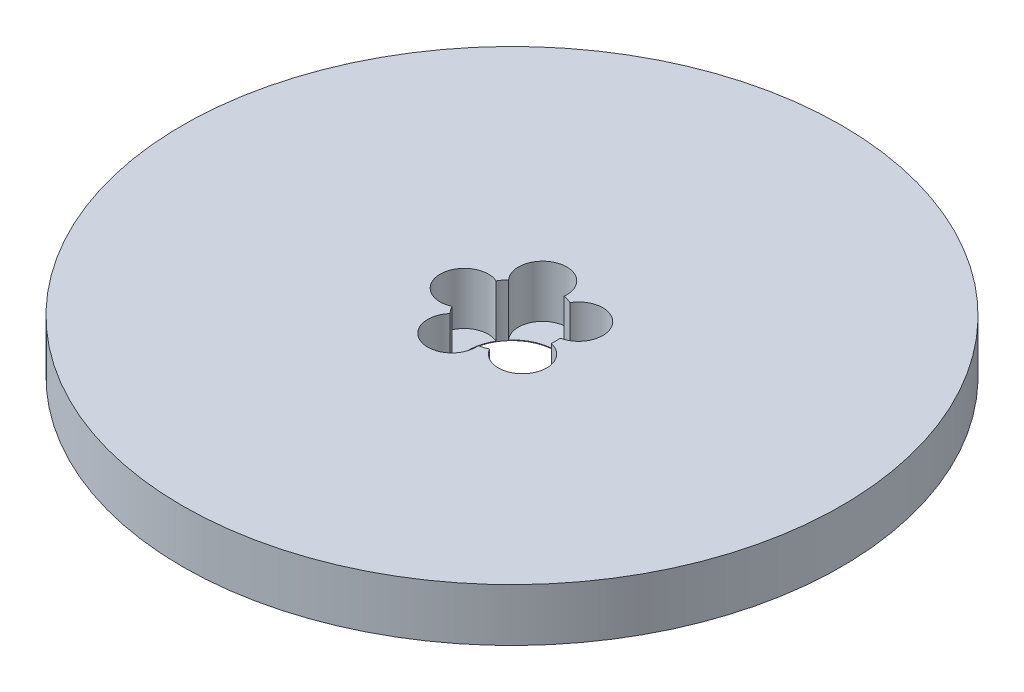
ISO-10303-21;
HEADER;
FILE_DESCRIPTION(('STEP AP214'),'2;1');
FILE_NAME('part.step','',(''),(''),'','','');
FILE_SCHEMA(('AUTOMOTIVE_DESIGN { 1 0 10303 214 1 1 1 1 }'));
ENDSEC;
DATA;
#1=APPLICATION_CONTEXT('core data for automotive mechanical design processes');
#2=APPLICATION_PROTOCOL_DEFINITION('international standard','automotive_design',2000,#1);
#3=PRODUCT_CONTEXT('',#1,'mechanical');
#4=PRODUCT('Part','Part','',(#3));
#5=PRODUCT_RELATED_PRODUCT_CATEGORY('part','',(#4));
#6=PRODUCT_DEFINITION_FORMATION('','',#4);
#7=PRODUCT_DEFINITION_CONTEXT('part definition',#1,'design');
#8=PRODUCT_DEFINITION('design','',#6,#7);
#9=PRODUCT_DEFINITION_SHAPE('','',#8);
#10=(LENGTH_UNIT() NAMED_UNIT(*) SI_UNIT(.MILLI.,.METRE.));
#11=(NAMED_UNIT(*) PLANE_ANGLE_UNIT() SI_UNIT($,.RADIAN.));
#12=(NAMED_UNIT(*) SI_UNIT($,.STERADIAN.) SOLID_ANGLE_UNIT());
#13=UNCERTAINTY_MEASURE_WITH_UNIT(LENGTH_MEASURE(1.E-05),#10,'distance_accuracy_value','');
#14=(GEOMETRIC_REPRESENTATION_CONTEXT(3) GLOBAL_UNCERTAINTY_ASSIGNED_CONTEXT((#13)) GLOBAL_UNIT_ASSIGNED_CONTEXT((#10,
#11,#12)) REPRESENTATION_CONTEXT('',''));
#15=CARTESIAN_POINT('',(0.,0.,0.));
#16=DIRECTION('',(0.,0.,1.));
#17=DIRECTION('',(1.,0.,0.));
#18=AXIS2_PLACEMENT_3D('',#15,#16,#17);
#19=CARTESIAN_POINT('',(0.,6.,0.));
#20=DIRECTION('',(0.,-1.,0.));
#21=DIRECTION('',(0.,0.,-1.));
#22=AXIS2_PLACEMENT_3D('',#19,#20,#21);
#23=CYLINDRICAL_SURFACE('',#22,37.5);
#24=CARTESIAN_POINT('',(0.,6.,0.));
#25=DIRECTION('',(0.,1.,0.));
#26=DIRECTION('',(0.,0.,1.));
#27=AXIS2_PLACEMENT_3D('',#24,#25,#26);
#28=CIRCLE('',#27,37.5);
#29=CARTESIAN_POINT('',(0.,6.,37.5));
#30=VERTEX_POINT('',#29);
#31=EDGE_CURVE('E157',#30,#30,#28,.T.);
#32=ORIENTED_EDGE('',*,*,#31,.F.);
#33=EDGE_LOOP('',(#32));
#34=FACE_BOUND('',#33,.T.);
#35=CARTESIAN_POINT('',(0.,0.,0.));
#36=DIRECTION('',(0.,1.,0.));
#37=DIRECTION('',(0.,0.,1.));
#38=AXIS2_PLACEMENT_3D('',#35,#36,#37);
#39=CIRCLE('',#38,37.5);
#40=CARTESIAN_POINT('',(0.,0.,37.5));
#41=VERTEX_POINT('',#40);
#42=EDGE_CURVE('E150',#41,#41,#39,.T.);
#43=ORIENTED_EDGE('',*,*,#42,.T.);
#44=EDGE_LOOP('',(#43));
#45=FACE_BOUND('',#44,.T.);
#46=ADVANCED_FACE('F39',(#34,#45),#23,.T.);
#47=CARTESIAN_POINT('',(0.,6.,0.));
#48=DIRECTION('',(0.,1.,0.));
#49=DIRECTION('',(0.,0.,1.));
#50=AXIS2_PLACEMENT_3D('',#47,#48,#49);
#51=PLANE('',#50);
#52=CARTESIAN_POINT('',(-1.67758170406622,6.,-5.16306559287081));
#53=DIRECTION('',(0.,1.,0.));
#54=DIRECTION('',(-0.95105651629515,0.,0.309016994374958));
#55=AXIS2_PLACEMENT_3D('',#52,#53,#54);
#56=CIRCLE('',#55,2.74677097780781);
#57=CARTESIAN_POINT('',(1.05531752534403,6.,-4.88736175463836));
#58=VERTEX_POINT('',#57);
#59=CARTESIAN_POINT('',(-3.72648897445981,6.,-3.3336586392775));
#60=VERTEX_POINT('',#59);
#61=EDGE_CURVE('E194',#58,#60,#56,.T.);
#62=ORIENTED_EDGE('',*,*,#61,.F.);
#63=CARTESIAN_POINT('',(0.,6.,0.));
#64=DIRECTION('',(0.,1.,0.));
#65=DIRECTION('',(0.,0.,1.));
#66=AXIS2_PLACEMENT_3D('',#63,#64,#65);
#67=CIRCLE('',#66,5.);
#68=CARTESIAN_POINT('',(2.01894934952956,6.,-4.57425879504365));
#69=VERTEX_POINT('',#68);
#70=EDGE_CURVE('E147',#69,#58,#67,.T.);
#71=ORIENTED_EDGE('',*,*,#70,.F.);
#72=CARTESIAN_POINT('',(4.39196592015014,6.,-3.19095002253934));
#73=DIRECTION('',(0.,1.,0.));
#74=DIRECTION('',(-0.58778525229248,0.,-0.809016994374942));
#75=AXIS2_PLACEMENT_3D('',#72,#73,#74);
#76=CIRCLE('',#75,2.74677097780781);
#77=CARTESIAN_POINT('',(4.97426829403355,6.,-0.506611230602483));
#78=VERTEX_POINT('',#77);
#79=EDGE_CURVE('E254',#78,#69,#76,.T.);
#80=ORIENTED_EDGE('',*,*,#79,.F.);
#81=CARTESIAN_POINT('',(4.97426829403356,6.,0.506611230602411));
#82=VERTEX_POINT('',#81);
#83=EDGE_CURVE('E144',#82,#78,#67,.T.);
#84=ORIENTED_EDGE('',*,*,#83,.F.);
#85=CARTESIAN_POINT('',(4.39196592015019,6.,3.19095002253927));
#86=DIRECTION('',(0.,1.,0.));
#87=DIRECTION('',(0.587785252292469,0.,-0.809016994374951));
#88=AXIS2_PLACEMENT_3D('',#85,#86,#87);
#89=CIRCLE('',#88,2.74677097780781);
#90=CARTESIAN_POINT('',(2.01894934952963,6.,4.57425879504362));
#91=VERTEX_POINT('',#90);
#92=EDGE_CURVE('E141',#91,#82,#89,.T.);
#93=ORIENTED_EDGE('',*,*,#92,.F.);
#94=CARTESIAN_POINT('',(1.0553175253441,6.,4.88736175463834));
#95=VERTEX_POINT('',#94);
#96=EDGE_CURVE('E134',#95,#91,#67,.T.);
#97=ORIENTED_EDGE('',*,*,#96,.F.);
#98=CARTESIAN_POINT('',(-1.67758170406615,6.,5.16306559287083));
#99=DIRECTION('',(0.,1.,0.));
#100=DIRECTION('',(0.951056516295155,0.,0.309016994374945));
#101=AXIS2_PLACEMENT_3D('',#98,#99,#100);
#102=CIRCLE('',#101,2.74677097780781);
#103=CARTESIAN_POINT('',(-3.72648897445976,6.,3.33365863927755));
#104=VERTEX_POINT('',#103);
#105=EDGE_CURVE('E111',#104,#95,#102,.T.);
#106=ORIENTED_EDGE('',*,*,#105,.F.);
#107=CARTESIAN_POINT('',(-4.32204619444748,6.,2.51394444908038));
#108=VERTEX_POINT('',#107);
#109=EDGE_CURVE('E145',#108,#104,#67,.T.);
#110=ORIENTED_EDGE('',*,*,#109,.F.);
#111=CARTESIAN_POINT('',(-5.42876843216803,6.,0.));
#112=DIRECTION('',(0.,1.,0.));
#113=DIRECTION('',(0.,0.,1.));
#114=AXIS2_PLACEMENT_3D('',#111,#112,#113);
#115=CIRCLE('',#114,2.74677097780781);
#116=CARTESIAN_POINT('',(-4.32204619444748,6.,-2.51394444908038));
#117=VERTEX_POINT('',#116);
#118=EDGE_CURVE('E153',#117,#108,#115,.T.);
#119=ORIENTED_EDGE('',*,*,#118,.F.);
#120=EDGE_CURVE('E146',#60,#117,#67,.T.);
#121=ORIENTED_EDGE('',*,*,#120,.F.);
#122=EDGE_LOOP('',(#62,#71,#80,#84,#93,#97,#106,#110,#119,#121));
#123=FACE_BOUND('',#122,.T.);
#124=ORIENTED_EDGE('',*,*,#31,.T.);
#125=EDGE_LOOP('',(#124));
#126=FACE_BOUND('',#125,.T.);
#127=ADVANCED_FACE('F139',(#123,#126),#51,.T.);
#128=CARTESIAN_POINT('',(0.,0.,0.));
#129=DIRECTION('',(0.,1.,0.));
#130=DIRECTION('',(0.,0.,1.));
#131=AXIS2_PLACEMENT_3D('',#128,#129,#130);
#132=PLANE('',#131);
#133=CARTESIAN_POINT('',(0.,0.,0.));
#134=DIRECTION('',(0.,1.,0.));
#135=DIRECTION('',(0.,0.,1.));
#136=AXIS2_PLACEMENT_3D('',#133,#134,#135);
#137=CIRCLE('',#136,5.);
#138=CARTESIAN_POINT('',(0.,0.,5.));
#139=VERTEX_POINT('',#138);
#140=EDGE_CURVE('E154',#139,#139,#137,.T.);
#141=ORIENTED_EDGE('',*,*,#140,.T.);
#142=EDGE_LOOP('',(#141));
#143=FACE_BOUND('',#142,.T.);
#144=ORIENTED_EDGE('',*,*,#42,.F.);
#145=EDGE_LOOP('',(#144));
#146=FACE_BOUND('',#145,.T.);
#147=ADVANCED_FACE('F213',(#143,#146),#132,.F.);
#148=CARTESIAN_POINT('',(0.,6.,0.));
#149=DIRECTION('',(0.,-1.,0.));
#150=DIRECTION('',(0.,0.,-1.));
#151=AXIS2_PLACEMENT_3D('',#148,#149,#150);
#152=CYLINDRICAL_SURFACE('',#151,5.);
#153=DIRECTION('',(0.,1.,0.));
#154=VECTOR('',#153,1.);
#155=CARTESIAN_POINT('',(1.05531752534403,3.03391343226891,-4.88736175463836));
#156=LINE('',#155,#154);
#157=CARTESIAN_POINT('',(1.05531752534403,0.0678268645378285,-4.88736175463836));
#158=VERTEX_POINT('',#157);
#159=EDGE_CURVE('E11',#158,#58,#156,.T.);
#160=ORIENTED_EDGE('',*,*,#159,.F.);
#161=CARTESIAN_POINT('',(0.,0.0678268645378285,0.));
#162=DIRECTION('',(0.,1.,0.));
#163=DIRECTION('',(0.,0.,1.));
#164=AXIS2_PLACEMENT_3D('',#161,#162,#163);
#165=CIRCLE('',#164,5.);
#166=CARTESIAN_POINT('',(-3.72648897445981,0.0678268645378285,-3.3336586392775));
#167=VERTEX_POINT('',#166);
#168=EDGE_CURVE('E189',#158,#167,#165,.T.);
#169=ORIENTED_EDGE('',*,*,#168,.T.);
#170=DIRECTION('',(0.,1.,0.));
#171=VECTOR('',#170,1.);
#172=CARTESIAN_POINT('',(-3.72648897445981,3.03391343226891,-3.3336586392775));
#173=LINE('',#172,#171);
#174=EDGE_CURVE('E46',#60,#167,#173,.F.);
#175=ORIENTED_EDGE('',*,*,#174,.F.);
#176=ORIENTED_EDGE('',*,*,#120,.T.);
#177=DIRECTION('',(0.,1.,0.));
#178=VECTOR('',#177,1.);
#179=CARTESIAN_POINT('',(-4.32204619444748,3.03391343226891,-2.51394444908038));
#180=LINE('',#179,#178);
#181=CARTESIAN_POINT('',(-4.32204619444748,0.0678268645378285,-2.51394444908038));
#182=VERTEX_POINT('',#181);
#183=EDGE_CURVE('E168',#182,#117,#180,.T.);
#184=ORIENTED_EDGE('',*,*,#183,.F.);
#185=CARTESIAN_POINT('',(0.,0.0678268645378285,0.));
#186=DIRECTION('',(0.,1.,0.));
#187=DIRECTION('',(0.,0.,1.));
#188=AXIS2_PLACEMENT_3D('',#185,#186,#187);
#189=CIRCLE('',#188,5.);
#190=CARTESIAN_POINT('',(-4.32204619444748,0.0678268645378285,2.51394444908038));
#191=VERTEX_POINT('',#190);
#192=EDGE_CURVE('E165',#182,#191,#189,.T.);
#193=ORIENTED_EDGE('',*,*,#192,.T.);
#194=DIRECTION('',(0.,1.,0.));
#195=VECTOR('',#194,1.);
#196=CARTESIAN_POINT('',(-4.32204619444748,3.03391343226891,2.51394444908038));
#197=LINE('',#196,#195);
#198=EDGE_CURVE('E170',#108,#191,#197,.F.);
#199=ORIENTED_EDGE('',*,*,#198,.F.);
#200=ORIENTED_EDGE('',*,*,#109,.T.);
#201=DIRECTION('',(0.,1.,0.));
#202=VECTOR('',#201,1.);
#203=CARTESIAN_POINT('',(-3.72648897445976,3.03391343226891,3.33365863927755));
#204=LINE('',#203,#202);
#205=CARTESIAN_POINT('',(-3.72648897445976,0.0678268645378285,3.33365863927755));
#206=VERTEX_POINT('',#205);
#207=EDGE_CURVE('E121',#206,#104,#204,.T.);
#208=ORIENTED_EDGE('',*,*,#207,.F.);
#209=CARTESIAN_POINT('',(0.,0.0678268645378285,0.));
#210=DIRECTION('',(0.,1.,0.));
#211=DIRECTION('',(0.,0.,1.));
#212=AXIS2_PLACEMENT_3D('',#209,#210,#211);
#213=CIRCLE('',#212,5.);
#214=CARTESIAN_POINT('',(1.0553175253441,0.0678268645378285,4.88736175463834));
#215=VERTEX_POINT('',#214);
#216=EDGE_CURVE('E136',#206,#215,#213,.T.);
#217=ORIENTED_EDGE('',*,*,#216,.T.);
#218=DIRECTION('',(0.,1.,0.));
#219=VECTOR('',#218,1.);
#220=CARTESIAN_POINT('',(1.0553175253441,3.03391343226891,4.88736175463834));
#221=LINE('',#220,#219);
#222=EDGE_CURVE('E117',#95,#215,#221,.F.);
#223=ORIENTED_EDGE('',*,*,#222,.F.);
#224=ORIENTED_EDGE('',*,*,#96,.T.);
#225=DIRECTION('',(0.,1.,0.));
#226=VECTOR('',#225,1.);
#227=CARTESIAN_POINT('',(2.01894934952963,3.03391343226891,4.57425879504362));
#228=LINE('',#227,#226);
#229=CARTESIAN_POINT('',(2.01894934952963,0.0678268645378285,4.57425879504362));
#230=VERTEX_POINT('',#229);
#231=EDGE_CURVE('E182',#230,#91,#228,.T.);
#232=ORIENTED_EDGE('',*,*,#231,.F.);
#233=CARTESIAN_POINT('',(0.,0.0678268645378285,0.));
#234=DIRECTION('',(0.,1.,0.));
#235=DIRECTION('',(0.,0.,1.));
#236=AXIS2_PLACEMENT_3D('',#233,#234,#235);
#237=CIRCLE('',#236,5.);
#238=CARTESIAN_POINT('',(4.97426829403356,0.0678268645378285,0.506611230602411));
#239=VERTEX_POINT('',#238);
#240=EDGE_CURVE('E174',#230,#239,#237,.T.);
#241=ORIENTED_EDGE('',*,*,#240,.T.);
#242=DIRECTION('',(0.,1.,0.));
#243=VECTOR('',#242,1.);
#244=CARTESIAN_POINT('',(4.97426829403356,3.03391343226891,0.506611230602411));
#245=LINE('',#244,#243);
#246=EDGE_CURVE('E177',#82,#239,#245,.F.);
#247=ORIENTED_EDGE('',*,*,#246,.F.);
#248=ORIENTED_EDGE('',*,*,#83,.T.);
#249=DIRECTION('',(0.,1.,0.));
#250=VECTOR('',#249,1.);
#251=CARTESIAN_POINT('',(4.97426829403355,3.03391343226891,-0.506611230602483));
#252=LINE('',#251,#250);
#253=CARTESIAN_POINT('',(4.97426829403355,0.0678268645378285,-0.506611230602483));
#254=VERTEX_POINT('',#253);
#255=EDGE_CURVE('E187',#254,#78,#252,.T.);
#256=ORIENTED_EDGE('',*,*,#255,.F.);
#257=CARTESIAN_POINT('',(0.,0.0678268645378285,0.));
#258=DIRECTION('',(0.,1.,0.));
#259=DIRECTION('',(0.,0.,1.));
#260=AXIS2_PLACEMENT_3D('',#257,#258,#259);
#261=CIRCLE('',#260,5.);
#262=CARTESIAN_POINT('',(2.01894934952956,0.0678268645378285,-4.57425879504365));
#263=VERTEX_POINT('',#262);
#264=EDGE_CURVE('E181',#254,#263,#261,.T.);
#265=ORIENTED_EDGE('',*,*,#264,.T.);
#266=DIRECTION('',(0.,1.,0.));
#267=VECTOR('',#266,1.);
#268=CARTESIAN_POINT('',(2.01894934952956,3.03391343226891,-4.57425879504365));
#269=LINE('',#268,#267);
#270=EDGE_CURVE('E186',#69,#263,#269,.F.);
#271=ORIENTED_EDGE('',*,*,#270,.F.);
#272=ORIENTED_EDGE('',*,*,#70,.T.);
#273=EDGE_LOOP('',(#160,#169,#175,#176,#184,#193,#199,#200,#208,#217,#223,#224,#232,#241,#247,
#248,#256,#265,#271,#272));
#274=FACE_BOUND('',#273,.T.);
#275=ORIENTED_EDGE('',*,*,#140,.F.);
#276=EDGE_LOOP('',(#275));
#277=FACE_BOUND('',#276,.T.);
#278=ADVANCED_FACE('F135',(#274,#277),#152,.F.);
#279=CARTESIAN_POINT('',(-5.42876843216803,0.0678268645378285,0.));
#280=DIRECTION('',(0.,1.,0.));
#281=DIRECTION('',(0.,0.,1.));
#282=AXIS2_PLACEMENT_3D('',#279,#280,#281);
#283=CYLINDRICAL_SURFACE('',#282,2.74677097780781);
#284=ORIENTED_EDGE('',*,*,#183,.T.);
#285=ORIENTED_EDGE('',*,*,#118,.T.);
#286=ORIENTED_EDGE('',*,*,#198,.T.);
#287=CARTESIAN_POINT('',(-5.42876843216803,0.0678268645378285,0.));
#288=DIRECTION('',(0.,1.,0.));
#289=DIRECTION('',(0.,0.,1.));
#290=AXIS2_PLACEMENT_3D('',#287,#288,#289);
#291=CIRCLE('',#290,2.74677097780781);
#292=EDGE_CURVE('E158',#182,#191,#291,.T.);
#293=ORIENTED_EDGE('',*,*,#292,.F.);
#294=EDGE_LOOP('',(#284,#285,#286,#293));
#295=FACE_BOUND('',#294,.T.);
#296=ADVANCED_FACE('F221',(#295),#283,.F.);
#297=CARTESIAN_POINT('',(-5.42876843216803,0.0678268645378285,0.));
#298=DIRECTION('',(0.,1.,0.));
#299=DIRECTION('',(0.,0.,1.));
#300=AXIS2_PLACEMENT_3D('',#297,#298,#299);
#301=PLANE('',#300);
#302=ORIENTED_EDGE('',*,*,#292,.T.);
#303=ORIENTED_EDGE('',*,*,#192,.F.);
#304=EDGE_LOOP('',(#302,#303));
#305=FACE_BOUND('',#304,.T.);
#306=ADVANCED_FACE('F227',(#305),#301,.T.);
#307=CARTESIAN_POINT('',(-1.67758170406615,0.0678268645378285,5.16306559287083));
#308=DIRECTION('',(0.,1.,0.));
#309=DIRECTION('',(0.,0.,1.));
#310=AXIS2_PLACEMENT_3D('',#307,#308,#309);
#311=CYLINDRICAL_SURFACE('',#310,2.74677097780781);
#312=ORIENTED_EDGE('',*,*,#207,.T.);
#313=ORIENTED_EDGE('',*,*,#105,.T.);
#314=ORIENTED_EDGE('',*,*,#222,.T.);
#315=CARTESIAN_POINT('',(-1.67758170406615,0.0678268645378285,5.16306559287083));
#316=DIRECTION('',(0.,1.,0.));
#317=DIRECTION('',(0.951056516295155,0.,0.309016994374945));
#318=AXIS2_PLACEMENT_3D('',#315,#316,#317);
#319=CIRCLE('',#318,2.74677097780781);
#320=EDGE_CURVE('E127',#206,#215,#319,.T.);
#321=ORIENTED_EDGE('',*,*,#320,.F.);
#322=EDGE_LOOP('',(#312,#313,#314,#321));
#323=FACE_BOUND('',#322,.T.);
#324=ADVANCED_FACE('F116',(#323),#311,.F.);
#325=CARTESIAN_POINT('',(-1.67758170406615,0.0678268645378285,5.16306559287083));
#326=DIRECTION('',(0.,1.,0.));
#327=DIRECTION('',(0.951056516295155,0.,0.309016994374945));
#328=AXIS2_PLACEMENT_3D('',#325,#326,#327);
#329=PLANE('',#328);
#330=ORIENTED_EDGE('',*,*,#320,.T.);
#331=ORIENTED_EDGE('',*,*,#216,.F.);
#332=EDGE_LOOP('',(#330,#331));
#333=FACE_BOUND('',#332,.T.);
#334=ADVANCED_FACE('F234',(#333),#329,.T.);
#335=CARTESIAN_POINT('',(4.39196592015019,0.0678268645378285,3.19095002253927));
#336=DIRECTION('',(0.,1.,0.));
#337=DIRECTION('',(0.,0.,1.));
#338=AXIS2_PLACEMENT_3D('',#335,#336,#337);
#339=CYLINDRICAL_SURFACE('',#338,2.74677097780781);
#340=ORIENTED_EDGE('',*,*,#231,.T.);
#341=ORIENTED_EDGE('',*,*,#92,.T.);
#342=ORIENTED_EDGE('',*,*,#246,.T.);
#343=CARTESIAN_POINT('',(4.39196592015019,0.0678268645378285,3.19095002253927));
#344=DIRECTION('',(0.,1.,0.));
#345=DIRECTION('',(0.587785252292469,0.,-0.809016994374951));
#346=AXIS2_PLACEMENT_3D('',#343,#344,#345);
#347=CIRCLE('',#346,2.74677097780781);
#348=EDGE_CURVE('E130',#230,#239,#347,.T.);
#349=ORIENTED_EDGE('',*,*,#348,.F.);
#350=EDGE_LOOP('',(#340,#341,#342,#349));
#351=FACE_BOUND('',#350,.T.);
#352=ADVANCED_FACE('F240',(#351),#339,.F.);
#353=CARTESIAN_POINT('',(4.39196592015019,0.0678268645378285,3.19095002253927));
#354=DIRECTION('',(0.,1.,0.));
#355=DIRECTION('',(0.587785252292469,0.,-0.809016994374951));
#356=AXIS2_PLACEMENT_3D('',#353,#354,#355);
#357=PLANE('',#356);
#358=ORIENTED_EDGE('',*,*,#348,.T.);
#359=ORIENTED_EDGE('',*,*,#240,.F.);
#360=EDGE_LOOP('',(#358,#359));
#361=FACE_BOUND('',#360,.T.);
#362=ADVANCED_FACE('F245',(#361),#357,.T.);
#363=CARTESIAN_POINT('',(4.39196592015014,0.0678268645378285,-3.19095002253934));
#364=DIRECTION('',(0.,1.,0.));
#365=DIRECTION('',(0.,0.,1.));
#366=AXIS2_PLACEMENT_3D('',#363,#364,#365);
#367=CYLINDRICAL_SURFACE('',#366,2.74677097780781);
#368=ORIENTED_EDGE('',*,*,#255,.T.);
#369=ORIENTED_EDGE('',*,*,#79,.T.);
#370=ORIENTED_EDGE('',*,*,#270,.T.);
#371=CARTESIAN_POINT('',(4.39196592015014,0.0678268645378285,-3.19095002253934));
#372=DIRECTION('',(0.,1.,0.));
#373=DIRECTION('',(-0.58778525229248,0.,-0.809016994374942));
#374=AXIS2_PLACEMENT_3D('',#371,#372,#373);
#375=CIRCLE('',#374,2.74677097780781);
#376=EDGE_CURVE('E56',#254,#263,#375,.T.);
#377=ORIENTED_EDGE('',*,*,#376,.F.);
#378=EDGE_LOOP('',(#368,#369,#370,#377));
#379=FACE_BOUND('',#378,.T.);
#380=ADVANCED_FACE('F266',(#379),#367,.F.);
#381=CARTESIAN_POINT('',(4.39196592015014,0.0678268645378285,-3.19095002253934));
#382=DIRECTION('',(0.,1.,0.));
#383=DIRECTION('',(-0.58778525229248,0.,-0.809016994374942));
#384=AXIS2_PLACEMENT_3D('',#381,#382,#383);
#385=PLANE('',#384);
#386=ORIENTED_EDGE('',*,*,#376,.T.);
#387=ORIENTED_EDGE('',*,*,#264,.F.);
#388=EDGE_LOOP('',(#386,#387));
#389=FACE_BOUND('',#388,.T.);
#390=ADVANCED_FACE('F204',(#389),#385,.T.);
#391=CARTESIAN_POINT('',(-1.67758170406622,0.0678268645378285,-5.16306559287081));
#392=DIRECTION('',(0.,1.,0.));
#393=DIRECTION('',(0.,0.,1.));
#394=AXIS2_PLACEMENT_3D('',#391,#392,#393);
#395=CYLINDRICAL_SURFACE('',#394,2.74677097780781);
#396=ORIENTED_EDGE('',*,*,#159,.T.);
#397=ORIENTED_EDGE('',*,*,#61,.T.);
#398=ORIENTED_EDGE('',*,*,#174,.T.);
#399=CARTESIAN_POINT('',(-1.67758170406622,0.0678268645378285,-5.16306559287081));
#400=DIRECTION('',(0.,1.,0.));
#401=DIRECTION('',(-0.95105651629515,0.,0.309016994374958));
#402=AXIS2_PLACEMENT_3D('',#399,#400,#401);
#403=CIRCLE('',#402,2.74677097780781);
#404=EDGE_CURVE('E55',#158,#167,#403,.T.);
#405=ORIENTED_EDGE('',*,*,#404,.F.);
#406=EDGE_LOOP('',(#396,#397,#398,#405));
#407=FACE_BOUND('',#406,.T.);
#408=ADVANCED_FACE('F193',(#407),#395,.F.);
#409=CARTESIAN_POINT('',(-1.67758170406622,0.0678268645378285,-5.16306559287081));
#410=DIRECTION('',(0.,1.,0.));
#411=DIRECTION('',(-0.95105651629515,0.,0.309016994374958));
#412=AXIS2_PLACEMENT_3D('',#409,#410,#411);
#413=PLANE('',#412);
#414=ORIENTED_EDGE('',*,*,#404,.T.);
#415=ORIENTED_EDGE('',*,*,#168,.F.);
#416=EDGE_LOOP('',(#414,#415));
#417=FACE_BOUND('',#416,.T.);
#418=ADVANCED_FACE('F196',(#417),#413,.T.);
#419=CLOSED_SHELL('',(#46,#127,#147,#278,#296,#306,#324,#334,#352,#362,#380,#390,#408,#418));
#420=MANIFOLD_SOLID_BREP('B2',#419);
#421=ADVANCED_BREP_SHAPE_REPRESENTATION('',(#18,#420),#14);
#422=SHAPE_DEFINITION_REPRESENTATION(#9,#421);
ENDSEC;
END-ISO-10303-21;
